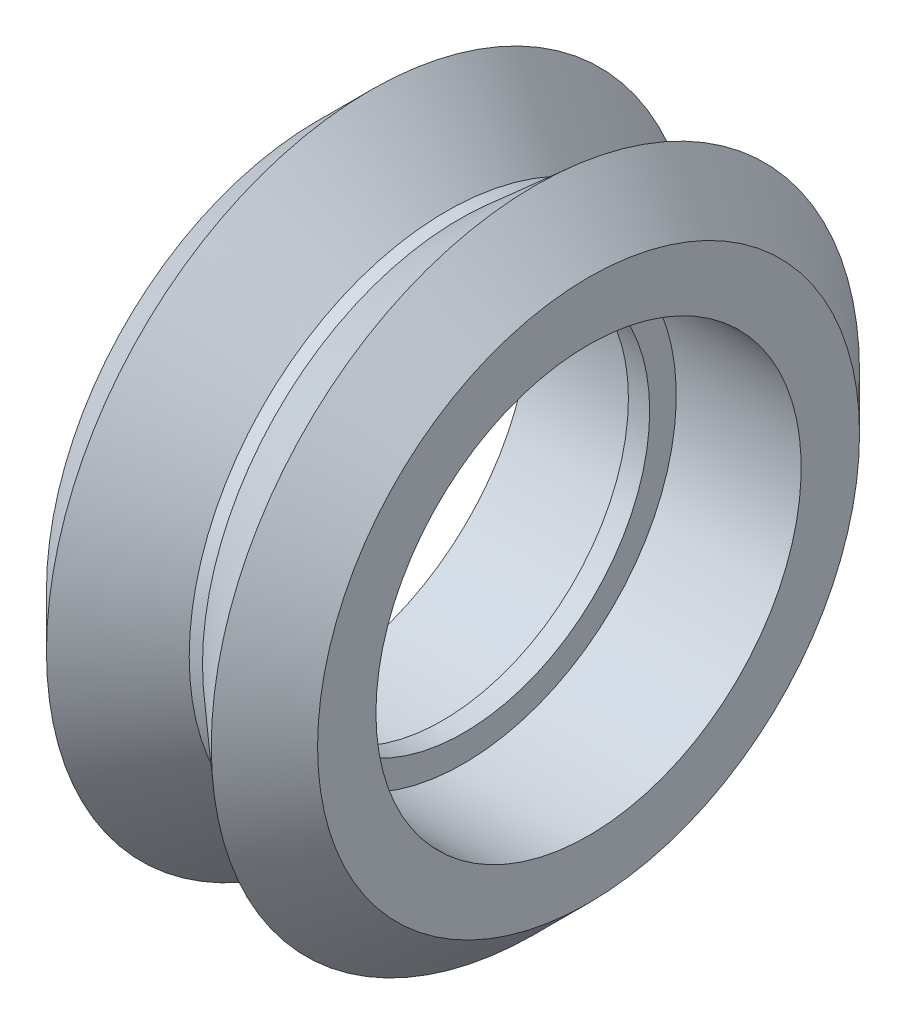
ISO-10303-21;
HEADER;
FILE_DESCRIPTION(('STEP AP214'),'2;1');
FILE_NAME('part.step','',(''),(''),'','','');
FILE_SCHEMA(('AUTOMOTIVE_DESIGN { 1 0 10303 214 1 1 1 1 }'));
ENDSEC;
DATA;
#1=APPLICATION_CONTEXT('core data for automotive mechanical design processes');
#2=APPLICATION_PROTOCOL_DEFINITION('international standard','automotive_design',2000,#1);
#3=PRODUCT_CONTEXT('',#1,'mechanical');
#4=PRODUCT('Part','Part','',(#3));
#5=PRODUCT_RELATED_PRODUCT_CATEGORY('part','',(#4));
#6=PRODUCT_DEFINITION_FORMATION('','',#4);
#7=PRODUCT_DEFINITION_CONTEXT('part definition',#1,'design');
#8=PRODUCT_DEFINITION('design','',#6,#7);
#9=PRODUCT_DEFINITION_SHAPE('','',#8);
#10=(LENGTH_UNIT() NAMED_UNIT(*) SI_UNIT(.MILLI.,.METRE.));
#11=(NAMED_UNIT(*) PLANE_ANGLE_UNIT() SI_UNIT($,.RADIAN.));
#12=(NAMED_UNIT(*) SI_UNIT($,.STERADIAN.) SOLID_ANGLE_UNIT());
#13=UNCERTAINTY_MEASURE_WITH_UNIT(LENGTH_MEASURE(1.E-05),#10,'distance_accuracy_value','');
#14=(GEOMETRIC_REPRESENTATION_CONTEXT(3) GLOBAL_UNCERTAINTY_ASSIGNED_CONTEXT((#13)) GLOBAL_UNIT_ASSIGNED_CONTEXT((#10,
#11,#12)) REPRESENTATION_CONTEXT('',''));
#15=CARTESIAN_POINT('',(0.,0.,0.));
#16=DIRECTION('',(0.,0.,1.));
#17=DIRECTION('',(1.,0.,0.));
#18=AXIS2_PLACEMENT_3D('',#15,#16,#17);
#19=CARTESIAN_POINT('',(-5.1,10.195,0.));
#20=DIRECTION('',(1.,0.,0.));
#21=DIRECTION('',(0.,0.,-1.));
#22=AXIS2_PLACEMENT_3D('',#19,#20,#21);
#23=PLANE('',#22);
#24=CARTESIAN_POINT('',(-5.09999999999999,0.,0.));
#25=DIRECTION('',(-1.,0.,0.));
#26=DIRECTION('',(0.,0.,1.));
#27=AXIS2_PLACEMENT_3D('',#24,#25,#26);
#28=CIRCLE('',#27,8.);
#29=CARTESIAN_POINT('',(-5.09999999999999,0.,8.));
#30=VERTEX_POINT('',#29);
#31=EDGE_CURVE('E9',#30,#30,#28,.T.);
#32=ORIENTED_EDGE('',*,*,#31,.F.);
#33=EDGE_LOOP('',(#32));
#34=FACE_BOUND('',#33,.T.);
#35=CARTESIAN_POINT('',(-5.09999999999999,0.,0.));
#36=DIRECTION('',(-1.,0.,0.));
#37=DIRECTION('',(0.,0.,1.));
#38=AXIS2_PLACEMENT_3D('',#35,#36,#37);
#39=CIRCLE('',#38,10.195);
#40=CARTESIAN_POINT('',(-5.09999999999999,0.,10.195));
#41=VERTEX_POINT('',#40);
#42=EDGE_CURVE('E54',#41,#41,#39,.T.);
#43=ORIENTED_EDGE('',*,*,#42,.T.);
#44=EDGE_LOOP('',(#43));
#45=FACE_BOUND('',#44,.T.);
#46=ADVANCED_FACE('F14',(#34,#45),#23,.F.);
#47=CARTESIAN_POINT('',(-73.8465771485865,0.,0.));
#48=DIRECTION('',(-1.,0.,0.));
#49=DIRECTION('',(0.,0.,1.));
#50=AXIS2_PLACEMENT_3D('',#47,#48,#49);
#51=CYLINDRICAL_SURFACE('',#50,8.);
#52=CARTESIAN_POINT('',(-0.399999999999998,0.,0.));
#53=DIRECTION('',(-1.,0.,0.));
#54=DIRECTION('',(0.,0.,1.));
#55=AXIS2_PLACEMENT_3D('',#52,#53,#54);
#56=CIRCLE('',#55,8.);
#57=CARTESIAN_POINT('',(-0.399999999999998,0.,8.));
#58=VERTEX_POINT('',#57);
#59=EDGE_CURVE('E20',#58,#58,#56,.T.);
#60=ORIENTED_EDGE('',*,*,#59,.F.);
#61=EDGE_LOOP('',(#60));
#62=FACE_BOUND('',#61,.T.);
#63=ORIENTED_EDGE('',*,*,#31,.T.);
#64=EDGE_LOOP('',(#63));
#65=FACE_BOUND('',#64,.T.);
#66=ADVANCED_FACE('F115',(#62,#65),#51,.F.);
#67=CARTESIAN_POINT('',(-0.399999999999999,8.,0.));
#68=DIRECTION('',(1.,0.,0.));
#69=DIRECTION('',(0.,0.,-1.));
#70=AXIS2_PLACEMENT_3D('',#67,#68,#69);
#71=PLANE('',#70);
#72=CARTESIAN_POINT('',(-0.399999999999998,0.,0.));
#73=DIRECTION('',(-1.,0.,0.));
#74=DIRECTION('',(0.,0.,1.));
#75=AXIS2_PLACEMENT_3D('',#72,#73,#74);
#76=CIRCLE('',#75,7.);
#77=CARTESIAN_POINT('',(-0.399999999999998,0.,7.));
#78=VERTEX_POINT('',#77);
#79=EDGE_CURVE('E24',#78,#78,#76,.T.);
#80=ORIENTED_EDGE('',*,*,#79,.F.);
#81=EDGE_LOOP('',(#80));
#82=FACE_BOUND('',#81,.T.);
#83=ORIENTED_EDGE('',*,*,#59,.T.);
#84=EDGE_LOOP('',(#83));
#85=FACE_BOUND('',#84,.T.);
#86=ADVANCED_FACE('F110',(#82,#85),#71,.F.);
#87=CARTESIAN_POINT('',(-73.8465771485865,0.,0.));
#88=DIRECTION('',(-1.,0.,0.));
#89=DIRECTION('',(0.,0.,1.));
#90=AXIS2_PLACEMENT_3D('',#87,#88,#89);
#91=CYLINDRICAL_SURFACE('',#90,7.);
#92=CARTESIAN_POINT('',(0.399999999999998,0.,0.));
#93=DIRECTION('',(-1.,0.,0.));
#94=DIRECTION('',(0.,0.,1.));
#95=AXIS2_PLACEMENT_3D('',#92,#93,#94);
#96=CIRCLE('',#95,7.);
#97=CARTESIAN_POINT('',(0.399999999999998,0.,7.));
#98=VERTEX_POINT('',#97);
#99=EDGE_CURVE('E28',#98,#98,#96,.T.);
#100=ORIENTED_EDGE('',*,*,#99,.F.);
#101=EDGE_LOOP('',(#100));
#102=FACE_BOUND('',#101,.T.);
#103=ORIENTED_EDGE('',*,*,#79,.T.);
#104=EDGE_LOOP('',(#103));
#105=FACE_BOUND('',#104,.T.);
#106=ADVANCED_FACE('F104',(#102,#105),#91,.F.);
#107=CARTESIAN_POINT('',(0.399999999999999,7.,0.));
#108=DIRECTION('',(-1.,0.,0.));
#109=DIRECTION('',(0.,0.,1.));
#110=AXIS2_PLACEMENT_3D('',#107,#108,#109);
#111=PLANE('',#110);
#112=CARTESIAN_POINT('',(0.399999999999998,0.,0.));
#113=DIRECTION('',(-1.,0.,0.));
#114=DIRECTION('',(0.,0.,1.));
#115=AXIS2_PLACEMENT_3D('',#112,#113,#114);
#116=CIRCLE('',#115,8.);
#117=CARTESIAN_POINT('',(0.399999999999998,0.,8.));
#118=VERTEX_POINT('',#117);
#119=EDGE_CURVE('E33',#118,#118,#116,.T.);
#120=ORIENTED_EDGE('',*,*,#119,.F.);
#121=EDGE_LOOP('',(#120));
#122=FACE_BOUND('',#121,.T.);
#123=ORIENTED_EDGE('',*,*,#99,.T.);
#124=EDGE_LOOP('',(#123));
#125=FACE_BOUND('',#124,.T.);
#126=ADVANCED_FACE('F98',(#122,#125),#111,.F.);
#127=CARTESIAN_POINT('',(-73.8465771485865,0.,0.));
#128=DIRECTION('',(-1.,0.,0.));
#129=DIRECTION('',(0.,0.,1.));
#130=AXIS2_PLACEMENT_3D('',#127,#128,#129);
#131=CYLINDRICAL_SURFACE('',#130,8.);
#132=CARTESIAN_POINT('',(5.09999999999999,0.,0.));
#133=DIRECTION('',(-1.,0.,0.));
#134=DIRECTION('',(0.,0.,1.));
#135=AXIS2_PLACEMENT_3D('',#132,#133,#134);
#136=CIRCLE('',#135,8.);
#137=CARTESIAN_POINT('',(5.09999999999999,0.,8.));
#138=VERTEX_POINT('',#137);
#139=EDGE_CURVE('E36',#138,#138,#136,.T.);
#140=ORIENTED_EDGE('',*,*,#139,.F.);
#141=EDGE_LOOP('',(#140));
#142=FACE_BOUND('',#141,.T.);
#143=ORIENTED_EDGE('',*,*,#119,.T.);
#144=EDGE_LOOP('',(#143));
#145=FACE_BOUND('',#144,.T.);
#146=ADVANCED_FACE('F92',(#142,#145),#131,.F.);
#147=CARTESIAN_POINT('',(5.1,8.,0.));
#148=DIRECTION('',(-1.,0.,0.));
#149=DIRECTION('',(0.,0.,1.));
#150=AXIS2_PLACEMENT_3D('',#147,#148,#149);
#151=PLANE('',#150);
#152=CARTESIAN_POINT('',(5.09999999999999,0.,0.));
#153=DIRECTION('',(-1.,0.,0.));
#154=DIRECTION('',(0.,0.,1.));
#155=AXIS2_PLACEMENT_3D('',#152,#153,#154);
#156=CIRCLE('',#155,10.195);
#157=CARTESIAN_POINT('',(5.09999999999999,0.,10.195));
#158=VERTEX_POINT('',#157);
#159=EDGE_CURVE('E39',#158,#158,#156,.T.);
#160=ORIENTED_EDGE('',*,*,#159,.F.);
#161=EDGE_LOOP('',(#160));
#162=FACE_BOUND('',#161,.T.);
#163=ORIENTED_EDGE('',*,*,#139,.T.);
#164=EDGE_LOOP('',(#163));
#165=FACE_BOUND('',#164,.T.);
#166=ADVANCED_FACE('F86',(#162,#165),#151,.F.);
#167=CARTESIAN_POINT('',(5.09999999999999,0.,0.));
#168=DIRECTION('',(-1.,0.,0.));
#169=DIRECTION('',(0.,0.,1.));
#170=AXIS2_PLACEMENT_3D('',#167,#168,#169);
#171=CONICAL_SURFACE('',#170,10.195,0.785398163397451);
#172=CARTESIAN_POINT('',(3.10000000000001,0.,0.));
#173=DIRECTION('',(-1.,0.,0.));
#174=DIRECTION('',(0.,0.,1.));
#175=AXIS2_PLACEMENT_3D('',#172,#173,#174);
#176=CIRCLE('',#175,12.195);
#177=CARTESIAN_POINT('',(3.10000000000001,0.,12.195));
#178=VERTEX_POINT('',#177);
#179=EDGE_CURVE('E42',#178,#178,#176,.T.);
#180=ORIENTED_EDGE('',*,*,#179,.F.);
#181=EDGE_LOOP('',(#180));
#182=FACE_BOUND('',#181,.T.);
#183=ORIENTED_EDGE('',*,*,#159,.T.);
#184=EDGE_LOOP('',(#183));
#185=FACE_BOUND('',#184,.T.);
#186=ADVANCED_FACE('F80',(#182,#185),#171,.T.);
#187=CARTESIAN_POINT('',(3.10000000000001,0.,0.));
#188=DIRECTION('',(1.,0.,0.));
#189=DIRECTION('',(0.,0.,-1.));
#190=AXIS2_PLACEMENT_3D('',#187,#188,#189);
#191=CONICAL_SURFACE('',#190,12.195,0.72402283128363);
#192=CARTESIAN_POINT('',(0.25,0.,0.));
#193=DIRECTION('',(-1.,0.,0.));
#194=DIRECTION('',(0.,0.,1.));
#195=AXIS2_PLACEMENT_3D('',#192,#193,#194);
#196=CIRCLE('',#195,9.675);
#197=CARTESIAN_POINT('',(0.25,0.,9.675));
#198=VERTEX_POINT('',#197);
#199=EDGE_CURVE('E45',#198,#198,#196,.T.);
#200=ORIENTED_EDGE('',*,*,#199,.F.);
#201=EDGE_LOOP('',(#200));
#202=FACE_BOUND('',#201,.T.);
#203=ORIENTED_EDGE('',*,*,#179,.T.);
#204=EDGE_LOOP('',(#203));
#205=FACE_BOUND('',#204,.T.);
#206=ADVANCED_FACE('F74',(#202,#205),#191,.T.);
#207=CARTESIAN_POINT('',(-73.8465771485865,0.,0.));
#208=DIRECTION('',(-1.,0.,0.));
#209=DIRECTION('',(0.,0.,1.));
#210=AXIS2_PLACEMENT_3D('',#207,#208,#209);
#211=CYLINDRICAL_SURFACE('',#210,9.675);
#212=CARTESIAN_POINT('',(-0.25,0.,0.));
#213=DIRECTION('',(-1.,0.,0.));
#214=DIRECTION('',(0.,0.,1.));
#215=AXIS2_PLACEMENT_3D('',#212,#213,#214);
#216=CIRCLE('',#215,9.675);
#217=CARTESIAN_POINT('',(-0.25,0.,9.675));
#218=VERTEX_POINT('',#217);
#219=EDGE_CURVE('E48',#218,#218,#216,.T.);
#220=ORIENTED_EDGE('',*,*,#219,.F.);
#221=EDGE_LOOP('',(#220));
#222=FACE_BOUND('',#221,.T.);
#223=ORIENTED_EDGE('',*,*,#199,.T.);
#224=EDGE_LOOP('',(#223));
#225=FACE_BOUND('',#224,.T.);
#226=ADVANCED_FACE('F68',(#222,#225),#211,.T.);
#227=CARTESIAN_POINT('',(-0.25,0.,0.));
#228=DIRECTION('',(-1.,0.,0.));
#229=DIRECTION('',(0.,0.,1.));
#230=AXIS2_PLACEMENT_3D('',#227,#228,#229);
#231=CONICAL_SURFACE('',#230,9.675,0.72402283128363);
#232=CARTESIAN_POINT('',(-3.10000000000001,0.,0.));
#233=DIRECTION('',(-1.,0.,0.));
#234=DIRECTION('',(0.,0.,1.));
#235=AXIS2_PLACEMENT_3D('',#232,#233,#234);
#236=CIRCLE('',#235,12.195);
#237=CARTESIAN_POINT('',(-3.10000000000001,0.,12.195));
#238=VERTEX_POINT('',#237);
#239=EDGE_CURVE('E51',#238,#238,#236,.T.);
#240=ORIENTED_EDGE('',*,*,#239,.F.);
#241=EDGE_LOOP('',(#240));
#242=FACE_BOUND('',#241,.T.);
#243=ORIENTED_EDGE('',*,*,#219,.T.);
#244=EDGE_LOOP('',(#243));
#245=FACE_BOUND('',#244,.T.);
#246=ADVANCED_FACE('F62',(#242,#245),#231,.T.);
#247=CARTESIAN_POINT('',(-3.10000000000001,0.,0.));
#248=DIRECTION('',(1.,0.,0.));
#249=DIRECTION('',(0.,0.,-1.));
#250=AXIS2_PLACEMENT_3D('',#247,#248,#249);
#251=CONICAL_SURFACE('',#250,12.195,0.785398163397451);
#252=ORIENTED_EDGE('',*,*,#42,.F.);
#253=EDGE_LOOP('',(#252));
#254=FACE_BOUND('',#253,.T.);
#255=ORIENTED_EDGE('',*,*,#239,.T.);
#256=EDGE_LOOP('',(#255));
#257=FACE_BOUND('',#256,.T.);
#258=ADVANCED_FACE('F59',(#254,#257),#251,.T.);
#259=CLOSED_SHELL('',(#46,#66,#86,#106,#126,#146,#166,#186,#206,#226,#246,#258));
#260=MANIFOLD_SOLID_BREP('B1',#259);
#261=ADVANCED_BREP_SHAPE_REPRESENTATION('',(#18,#260),#14);
#262=SHAPE_DEFINITION_REPRESENTATION(#9,#261);
ENDSEC;
END-ISO-10303-21;
